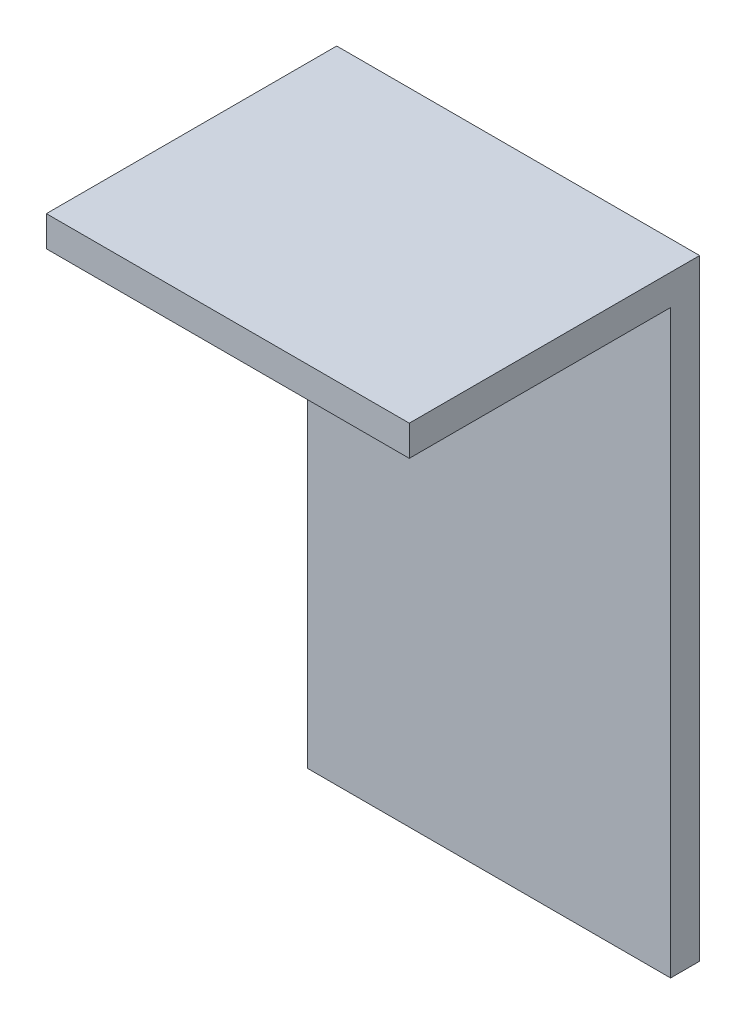
ISO-10303-21;
HEADER;
FILE_DESCRIPTION(('STEP AP214'),'2;1');
FILE_NAME('part.step','',(''),(''),'','','');
FILE_SCHEMA(('AUTOMOTIVE_DESIGN { 1 0 10303 214 1 1 1 1 }'));
ENDSEC;
DATA;
#1=APPLICATION_CONTEXT('core data for automotive mechanical design processes');
#2=APPLICATION_PROTOCOL_DEFINITION('international standard','automotive_design',2000,#1);
#3=PRODUCT_CONTEXT('',#1,'mechanical');
#4=PRODUCT('Part','Part','',(#3));
#5=PRODUCT_RELATED_PRODUCT_CATEGORY('part','',(#4));
#6=PRODUCT_DEFINITION_FORMATION('','',#4);
#7=PRODUCT_DEFINITION_CONTEXT('part definition',#1,'design');
#8=PRODUCT_DEFINITION('design','',#6,#7);
#9=PRODUCT_DEFINITION_SHAPE('','',#8);
#10=(LENGTH_UNIT() NAMED_UNIT(*) SI_UNIT(.MILLI.,.METRE.));
#11=(NAMED_UNIT(*) PLANE_ANGLE_UNIT() SI_UNIT($,.RADIAN.));
#12=(NAMED_UNIT(*) SI_UNIT($,.STERADIAN.) SOLID_ANGLE_UNIT());
#13=UNCERTAINTY_MEASURE_WITH_UNIT(LENGTH_MEASURE(1.E-05),#10,'distance_accuracy_value','');
#14=(GEOMETRIC_REPRESENTATION_CONTEXT(3) GLOBAL_UNCERTAINTY_ASSIGNED_CONTEXT((#13)) GLOBAL_UNIT_ASSIGNED_CONTEXT((#10,
#11,#12)) REPRESENTATION_CONTEXT('',''));
#15=CARTESIAN_POINT('',(0.,0.,0.));
#16=DIRECTION('',(0.,0.,1.));
#17=DIRECTION('',(1.,0.,0.));
#18=AXIS2_PLACEMENT_3D('',#15,#16,#17);
#19=CARTESIAN_POINT('',(-0.27832069959544,1.5105,0.2));
#20=DIRECTION('',(0.,0.,1.));
#21=DIRECTION('',(0.,-1.,0.));
#22=AXIS2_PLACEMENT_3D('',#19,#20,#21);
#23=PLANE('',#22);
#24=DIRECTION('',(1.,0.,0.));
#25=VECTOR('',#24,1.);
#26=CARTESIAN_POINT('',(-0.27832069959544,1.521,0.2));
#27=LINE('',#26,#25);
#28=CARTESIAN_POINT('',(-0.403320699595441,1.521,0.2));
#29=VERTEX_POINT('',#28);
#30=CARTESIAN_POINT('',(-0.153320699595441,1.521,0.2));
#31=VERTEX_POINT('',#30);
#32=EDGE_CURVE('E104',#29,#31,#27,.T.);
#33=ORIENTED_EDGE('',*,*,#32,.F.);
#34=DIRECTION('',(0.,-1.,0.));
#35=VECTOR('',#34,1.);
#36=CARTESIAN_POINT('',(-0.403320699595441,1.36847101449275,0.2));
#37=LINE('',#36,#35);
#38=CARTESIAN_POINT('',(-0.403320699595441,1.5,0.2));
#39=VERTEX_POINT('',#38);
#40=EDGE_CURVE('E116',#29,#39,#37,.T.);
#41=ORIENTED_EDGE('',*,*,#40,.T.);
#42=DIRECTION('',(1.,0.,0.));
#43=VECTOR('',#42,1.);
#44=CARTESIAN_POINT('',(-0.27832069959544,1.5,0.2));
#45=LINE('',#44,#43);
#46=CARTESIAN_POINT('',(-0.153320699595441,1.5,0.2));
#47=VERTEX_POINT('',#46);
#48=EDGE_CURVE('E11',#39,#47,#45,.T.);
#49=ORIENTED_EDGE('',*,*,#48,.T.);
#50=DIRECTION('',(0.,-1.,0.));
#51=VECTOR('',#50,1.);
#52=CARTESIAN_POINT('',(-0.15332069959544,1.36847101449275,0.2));
#53=LINE('',#52,#51);
#54=EDGE_CURVE('E136',#31,#47,#53,.T.);
#55=ORIENTED_EDGE('',*,*,#54,.F.);
#56=EDGE_LOOP('',(#33,#41,#49,#55));
#57=FACE_BOUND('',#56,.T.);
#58=ADVANCED_FACE('F16',(#57),#23,.T.);
#59=CARTESIAN_POINT('',(-0.27832069959544,1.5,0.11));
#60=DIRECTION('',(0.,1.,0.));
#61=DIRECTION('',(1.,0.,0.));
#62=AXIS2_PLACEMENT_3D('',#59,#60,#61);
#63=PLANE('',#62);
#64=DIRECTION('',(0.,0.,-1.));
#65=VECTOR('',#64,1.);
#66=CARTESIAN_POINT('',(-0.403320699595441,1.5,0.0420289855072457));
#67=LINE('',#66,#65);
#68=CARTESIAN_POINT('',(-0.403320699595441,1.5,0.02));
#69=VERTEX_POINT('',#68);
#70=EDGE_CURVE('E110',#39,#69,#67,.T.);
#71=ORIENTED_EDGE('',*,*,#70,.T.);
#72=DIRECTION('',(-1.,0.,0.));
#73=VECTOR('',#72,1.);
#74=CARTESIAN_POINT('',(-0.27832069959544,1.5,0.02));
#75=LINE('',#74,#73);
#76=CARTESIAN_POINT('',(-0.15332069959544,1.5,0.02));
#77=VERTEX_POINT('',#76);
#78=EDGE_CURVE('E27',#77,#69,#75,.T.);
#79=ORIENTED_EDGE('',*,*,#78,.F.);
#80=DIRECTION('',(0.,0.,-1.));
#81=VECTOR('',#80,1.);
#82=CARTESIAN_POINT('',(-0.153320699595441,1.5,0.0420289855072457));
#83=LINE('',#82,#81);
#84=EDGE_CURVE('E130',#47,#77,#83,.T.);
#85=ORIENTED_EDGE('',*,*,#84,.F.);
#86=ORIENTED_EDGE('',*,*,#48,.F.);
#87=EDGE_LOOP('',(#71,#79,#85,#86));
#88=FACE_BOUND('',#87,.T.);
#89=ADVANCED_FACE('F172',(#88),#63,.F.);
#90=CARTESIAN_POINT('',(-0.27832069959544,1.3,0.02));
#91=DIRECTION('',(0.,0.,1.));
#92=DIRECTION('',(0.,-1.,0.));
#93=AXIS2_PLACEMENT_3D('',#90,#91,#92);
#94=PLANE('',#93);
#95=DIRECTION('',(0.,-1.,0.));
#96=VECTOR('',#95,1.);
#97=CARTESIAN_POINT('',(-0.403320699595441,1.36847101449275,0.02));
#98=LINE('',#97,#96);
#99=CARTESIAN_POINT('',(-0.40332069959544,1.1,0.02));
#100=VERTEX_POINT('',#99);
#101=EDGE_CURVE('E99',#69,#100,#98,.T.);
#102=ORIENTED_EDGE('',*,*,#101,.T.);
#103=DIRECTION('',(1.,0.,0.));
#104=VECTOR('',#103,1.);
#105=CARTESIAN_POINT('',(-0.27832069959544,1.1,0.02));
#106=LINE('',#105,#104);
#107=CARTESIAN_POINT('',(-0.153320699595439,1.1,0.02));
#108=VERTEX_POINT('',#107);
#109=EDGE_CURVE('E42',#100,#108,#106,.T.);
#110=ORIENTED_EDGE('',*,*,#109,.T.);
#111=DIRECTION('',(0.,-1.,0.));
#112=VECTOR('',#111,1.);
#113=CARTESIAN_POINT('',(-0.15332069959544,1.36847101449275,0.02));
#114=LINE('',#113,#112);
#115=EDGE_CURVE('E123',#77,#108,#114,.T.);
#116=ORIENTED_EDGE('',*,*,#115,.F.);
#117=ORIENTED_EDGE('',*,*,#78,.T.);
#118=EDGE_LOOP('',(#102,#110,#116,#117));
#119=FACE_BOUND('',#118,.T.);
#120=ADVANCED_FACE('F107',(#119),#94,.T.);
#121=CARTESIAN_POINT('',(-0.27832069959544,1.1,0.01));
#122=DIRECTION('',(0.,1.,0.));
#123=DIRECTION('',(1.,0.,0.));
#124=AXIS2_PLACEMENT_3D('',#121,#122,#123);
#125=PLANE('',#124);
#126=DIRECTION('',(0.,0.,-1.));
#127=VECTOR('',#126,1.);
#128=CARTESIAN_POINT('',(-0.153320699595439,1.1,0.0420289855072457));
#129=LINE('',#128,#127);
#130=CARTESIAN_POINT('',(-0.153320699595439,1.1,0.));
#131=VERTEX_POINT('',#130);
#132=EDGE_CURVE('E86',#108,#131,#129,.T.);
#133=ORIENTED_EDGE('',*,*,#132,.F.);
#134=ORIENTED_EDGE('',*,*,#109,.F.);
#135=DIRECTION('',(0.,0.,-1.));
#136=VECTOR('',#135,1.);
#137=CARTESIAN_POINT('',(-0.40332069959544,1.1,0.0420289855072457));
#138=LINE('',#137,#136);
#139=CARTESIAN_POINT('',(-0.40332069959544,1.1,0.));
#140=VERTEX_POINT('',#139);
#141=EDGE_CURVE('E73',#100,#140,#138,.T.);
#142=ORIENTED_EDGE('',*,*,#141,.T.);
#143=DIRECTION('',(1.,0.,0.));
#144=VECTOR('',#143,1.);
#145=CARTESIAN_POINT('',(-0.27832069959544,1.1,0.));
#146=LINE('',#145,#144);
#147=EDGE_CURVE('E119',#140,#131,#146,.T.);
#148=ORIENTED_EDGE('',*,*,#147,.T.);
#149=EDGE_LOOP('',(#133,#134,#142,#148));
#150=FACE_BOUND('',#149,.T.);
#151=ADVANCED_FACE('F94',(#150),#125,.F.);
#152=CARTESIAN_POINT('',(-0.15332069959544,1.36847101449275,0.0420289855072457));
#153=DIRECTION('',(1.,0.,0.));
#154=DIRECTION('',(0.,1.,0.));
#155=AXIS2_PLACEMENT_3D('',#152,#153,#154);
#156=PLANE('',#155);
#157=DIRECTION('',(0.,0.,-1.));
#158=VECTOR('',#157,1.);
#159=CARTESIAN_POINT('',(-0.153320699595441,1.521,0.0999999999999988));
#160=LINE('',#159,#158);
#161=CARTESIAN_POINT('',(-0.153320699595441,1.521,0.));
#162=VERTEX_POINT('',#161);
#163=EDGE_CURVE('E141',#31,#162,#160,.T.);
#164=ORIENTED_EDGE('',*,*,#163,.F.);
#165=ORIENTED_EDGE('',*,*,#54,.T.);
#166=ORIENTED_EDGE('',*,*,#84,.T.);
#167=ORIENTED_EDGE('',*,*,#115,.T.);
#168=ORIENTED_EDGE('',*,*,#132,.T.);
#169=DIRECTION('',(0.,1.,0.));
#170=VECTOR('',#169,1.);
#171=CARTESIAN_POINT('',(-0.153320699595439,1.3105,0.));
#172=LINE('',#171,#170);
#173=EDGE_CURVE('E20',#131,#162,#172,.T.);
#174=ORIENTED_EDGE('',*,*,#173,.T.);
#175=EDGE_LOOP('',(#164,#165,#166,#167,#168,#174));
#176=FACE_BOUND('',#175,.T.);
#177=ADVANCED_FACE('F161',(#176),#156,.T.);
#178=CARTESIAN_POINT('',(-0.27832069959544,1.521,0.0999999999999988));
#179=DIRECTION('',(0.,1.,0.));
#180=DIRECTION('',(1.,0.,0.));
#181=AXIS2_PLACEMENT_3D('',#178,#179,#180);
#182=PLANE('',#181);
#183=ORIENTED_EDGE('',*,*,#32,.T.);
#184=ORIENTED_EDGE('',*,*,#163,.T.);
#185=DIRECTION('',(-1.,0.,0.));
#186=VECTOR('',#185,1.);
#187=CARTESIAN_POINT('',(-0.27832069959544,1.521,0.));
#188=LINE('',#187,#186);
#189=CARTESIAN_POINT('',(-0.403320699595441,1.521,0.));
#190=VERTEX_POINT('',#189);
#191=EDGE_CURVE('E145',#162,#190,#188,.T.);
#192=ORIENTED_EDGE('',*,*,#191,.T.);
#193=DIRECTION('',(0.,0.,1.));
#194=VECTOR('',#193,1.);
#195=CARTESIAN_POINT('',(-0.403320699595441,1.521,0.0420289855072457));
#196=LINE('',#195,#194);
#197=EDGE_CURVE('E105',#190,#29,#196,.T.);
#198=ORIENTED_EDGE('',*,*,#197,.T.);
#199=EDGE_LOOP('',(#183,#184,#192,#198));
#200=FACE_BOUND('',#199,.T.);
#201=ADVANCED_FACE('F157',(#200),#182,.T.);
#202=CARTESIAN_POINT('',(-0.403320699595441,1.36847101449275,0.0420289855072457));
#203=DIRECTION('',(1.,0.,0.));
#204=DIRECTION('',(0.,1.,0.));
#205=AXIS2_PLACEMENT_3D('',#202,#203,#204);
#206=PLANE('',#205);
#207=ORIENTED_EDGE('',*,*,#101,.F.);
#208=ORIENTED_EDGE('',*,*,#70,.F.);
#209=ORIENTED_EDGE('',*,*,#40,.F.);
#210=ORIENTED_EDGE('',*,*,#197,.F.);
#211=DIRECTION('',(0.,-1.,0.));
#212=VECTOR('',#211,1.);
#213=CARTESIAN_POINT('',(-0.403320699595441,1.3105,0.));
#214=LINE('',#213,#212);
#215=EDGE_CURVE('E101',#190,#140,#214,.T.);
#216=ORIENTED_EDGE('',*,*,#215,.T.);
#217=ORIENTED_EDGE('',*,*,#141,.F.);
#218=EDGE_LOOP('',(#207,#208,#209,#210,#216,#217));
#219=FACE_BOUND('',#218,.T.);
#220=ADVANCED_FACE('F18',(#219),#206,.F.);
#221=CARTESIAN_POINT('',(-0.27832069959544,1.3105,0.));
#222=DIRECTION('',(0.,0.,1.));
#223=DIRECTION('',(0.,-1.,0.));
#224=AXIS2_PLACEMENT_3D('',#221,#222,#223);
#225=PLANE('',#224);
#226=ORIENTED_EDGE('',*,*,#191,.F.);
#227=ORIENTED_EDGE('',*,*,#173,.F.);
#228=ORIENTED_EDGE('',*,*,#147,.F.);
#229=ORIENTED_EDGE('',*,*,#215,.F.);
#230=EDGE_LOOP('',(#226,#227,#228,#229));
#231=FACE_BOUND('',#230,.T.);
#232=ADVANCED_FACE('F164',(#231),#225,.F.);
#233=CLOSED_SHELL('',(#58,#89,#120,#151,#177,#201,#220,#232));
#234=MANIFOLD_SOLID_BREP('B1',#233);
#235=ADVANCED_BREP_SHAPE_REPRESENTATION('',(#18,#234),#14);
#236=SHAPE_DEFINITION_REPRESENTATION(#9,#235);
ENDSEC;
END-ISO-10303-21;
